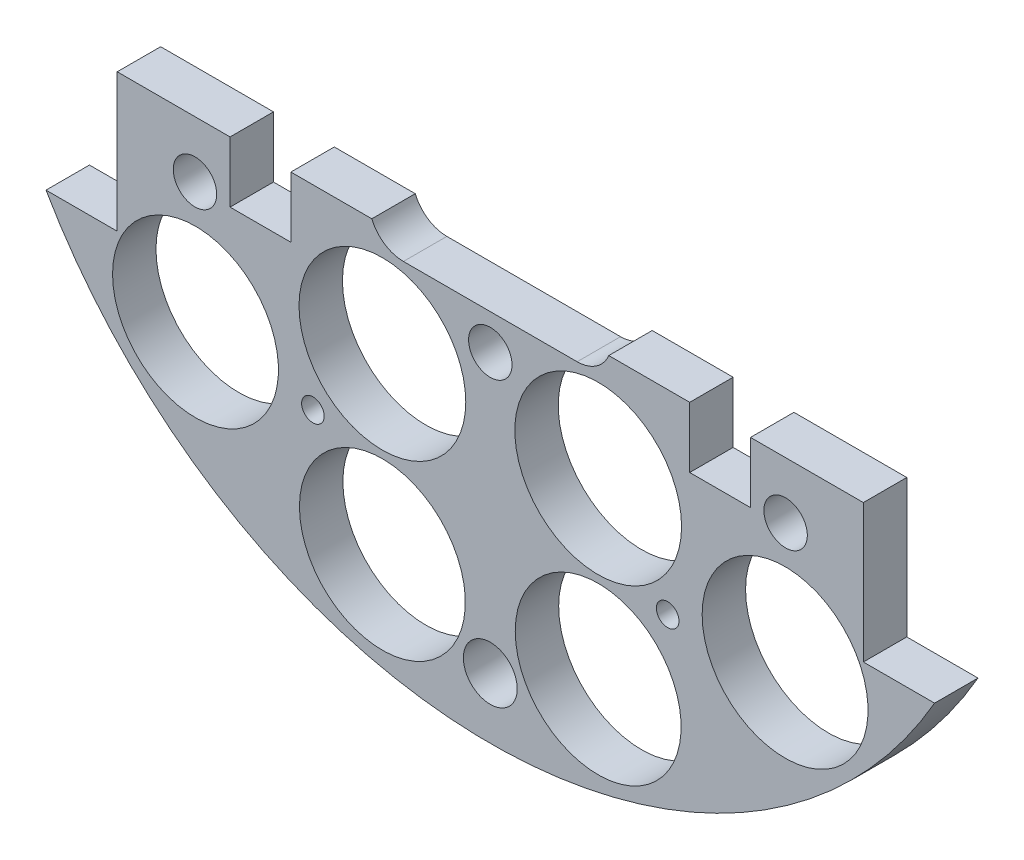
ISO-10303-21;
HEADER;
FILE_DESCRIPTION(('STEP AP214'),'2;1');
FILE_NAME('part.step','',(''),(''),'','','');
FILE_SCHEMA(('AUTOMOTIVE_DESIGN { 1 0 10303 214 1 1 1 1 }'));
ENDSEC;
DATA;
#1=APPLICATION_CONTEXT('core data for automotive mechanical design processes');
#2=APPLICATION_PROTOCOL_DEFINITION('international standard','automotive_design',2000,#1);
#3=PRODUCT_CONTEXT('',#1,'mechanical');
#4=PRODUCT('Part','Part','',(#3));
#5=PRODUCT_RELATED_PRODUCT_CATEGORY('part','',(#4));
#6=PRODUCT_DEFINITION_FORMATION('','',#4);
#7=PRODUCT_DEFINITION_CONTEXT('part definition',#1,'design');
#8=PRODUCT_DEFINITION('design','',#6,#7);
#9=PRODUCT_DEFINITION_SHAPE('','',#8);
#10=(LENGTH_UNIT() NAMED_UNIT(*) SI_UNIT(.MILLI.,.METRE.));
#11=(NAMED_UNIT(*) PLANE_ANGLE_UNIT() SI_UNIT($,.RADIAN.));
#12=(NAMED_UNIT(*) SI_UNIT($,.STERADIAN.) SOLID_ANGLE_UNIT());
#13=UNCERTAINTY_MEASURE_WITH_UNIT(LENGTH_MEASURE(1.E-05),#10,'distance_accuracy_value','');
#14=(GEOMETRIC_REPRESENTATION_CONTEXT(3) GLOBAL_UNCERTAINTY_ASSIGNED_CONTEXT((#13)) GLOBAL_UNIT_ASSIGNED_CONTEXT((#10,
#11,#12)) REPRESENTATION_CONTEXT('',''));
#15=CARTESIAN_POINT('',(0.,0.,0.));
#16=DIRECTION('',(0.,0.,1.));
#17=DIRECTION('',(1.,0.,0.));
#18=AXIS2_PLACEMENT_3D('',#15,#16,#17);
#19=CARTESIAN_POINT('',(85.0440360772851,-17.145,6.35));
#20=DIRECTION('',(0.,-1.,0.));
#21=DIRECTION('',(0.,0.,-1.));
#22=AXIS2_PLACEMENT_3D('',#19,#20,#21);
#23=PLANE('',#22);
#24=DIRECTION('',(-1.,0.,0.));
#25=VECTOR('',#24,1.);
#26=CARTESIAN_POINT('',(85.0440360772851,-17.145,6.35));
#27=LINE('',#26,#25);
#28=CARTESIAN_POINT('',(-17.3228751875862,-17.145,6.35));
#29=VERTEX_POINT('',#28);
#30=CARTESIAN_POINT('',(-29.1604414737786,-17.145,6.35));
#31=VERTEX_POINT('',#30);
#32=EDGE_CURVE('E268',#29,#31,#27,.T.);
#33=ORIENTED_EDGE('',*,*,#32,.F.);
#34=DIRECTION('',(0.,0.,-1.));
#35=VECTOR('',#34,1.);
#36=CARTESIAN_POINT('',(-17.3228751875862,-17.145,21.59));
#37=LINE('',#36,#35);
#38=CARTESIAN_POINT('',(-17.3228751875862,-17.145,0.));
#39=VERTEX_POINT('',#38);
#40=EDGE_CURVE('E191',#29,#39,#37,.T.);
#41=ORIENTED_EDGE('',*,*,#40,.T.);
#42=DIRECTION('',(-1.,0.,0.));
#43=VECTOR('',#42,1.);
#44=CARTESIAN_POINT('',(85.0440360772851,-17.145,0.));
#45=LINE('',#44,#43);
#46=CARTESIAN_POINT('',(-29.1604414737786,-17.145,0.));
#47=VERTEX_POINT('',#46);
#48=EDGE_CURVE('E274',#39,#47,#45,.T.);
#49=ORIENTED_EDGE('',*,*,#48,.T.);
#50=DIRECTION('',(0.,0.,-1.));
#51=VECTOR('',#50,1.);
#52=CARTESIAN_POINT('',(-29.1604414737786,-17.145,6.35));
#53=LINE('',#52,#51);
#54=EDGE_CURVE('E222',#31,#47,#53,.T.);
#55=ORIENTED_EDGE('',*,*,#54,.F.);
#56=EDGE_LOOP('',(#33,#41,#49,#55));
#57=FACE_BOUND('',#56,.T.);
#58=ADVANCED_FACE('F33',(#57),#23,.F.);
#59=CARTESIAN_POINT('',(29.1604414737786,-17.145,0.));
#60=VERTEX_POINT('',#59);
#61=CARTESIAN_POINT('',(17.3228751875862,-17.145,0.));
#62=VERTEX_POINT('',#61);
#63=EDGE_CURVE('E273',#60,#62,#45,.T.);
#64=ORIENTED_EDGE('',*,*,#63,.T.);
#65=DIRECTION('',(0.,0.,-1.));
#66=VECTOR('',#65,1.);
#67=CARTESIAN_POINT('',(17.3228751875862,-17.145,21.59));
#68=LINE('',#67,#66);
#69=CARTESIAN_POINT('',(17.3228751875862,-17.145,6.35));
#70=VERTEX_POINT('',#69);
#71=EDGE_CURVE('E48',#62,#70,#68,.F.);
#72=ORIENTED_EDGE('',*,*,#71,.T.);
#73=CARTESIAN_POINT('',(29.1604414737786,-17.145,6.35));
#74=VERTEX_POINT('',#73);
#75=EDGE_CURVE('E267',#74,#70,#27,.T.);
#76=ORIENTED_EDGE('',*,*,#75,.F.);
#77=DIRECTION('',(0.,0.,-1.));
#78=VECTOR('',#77,1.);
#79=CARTESIAN_POINT('',(29.1604414737786,-17.145,6.35));
#80=LINE('',#79,#78);
#81=EDGE_CURVE('E251',#74,#60,#80,.T.);
#82=ORIENTED_EDGE('',*,*,#81,.T.);
#83=EDGE_LOOP('',(#64,#72,#76,#82));
#84=FACE_BOUND('',#83,.T.);
#85=ADVANCED_FACE('F364',(#84),#23,.F.);
#86=CARTESIAN_POINT('',(54.5504414737786,-17.145,0.));
#87=VERTEX_POINT('',#86);
#88=CARTESIAN_POINT('',(38.0504414737786,-17.145,0.));
#89=VERTEX_POINT('',#88);
#90=EDGE_CURVE('E269',#87,#89,#45,.T.);
#91=ORIENTED_EDGE('',*,*,#90,.T.);
#92=DIRECTION('',(0.,0.,-1.));
#93=VECTOR('',#92,1.);
#94=CARTESIAN_POINT('',(38.0504414737786,-17.145,6.35));
#95=LINE('',#94,#93);
#96=CARTESIAN_POINT('',(38.0504414737786,-17.145,6.35));
#97=VERTEX_POINT('',#96);
#98=EDGE_CURVE('E248',#97,#89,#95,.T.);
#99=ORIENTED_EDGE('',*,*,#98,.F.);
#100=CARTESIAN_POINT('',(54.5504414737786,-17.145,6.35));
#101=VERTEX_POINT('',#100);
#102=EDGE_CURVE('E263',#101,#97,#27,.T.);
#103=ORIENTED_EDGE('',*,*,#102,.F.);
#104=DIRECTION('',(0.,0.,1.));
#105=VECTOR('',#104,1.);
#106=CARTESIAN_POINT('',(54.5504414737786,-17.145,6.35));
#107=LINE('',#106,#105);
#108=EDGE_CURVE('E41',#87,#101,#107,.T.);
#109=ORIENTED_EDGE('',*,*,#108,.F.);
#110=EDGE_LOOP('',(#91,#99,#103,#109));
#111=FACE_BOUND('',#110,.T.);
#112=ADVANCED_FACE('F371',(#111),#23,.F.);
#113=CARTESIAN_POINT('',(0.,0.,6.35));
#114=DIRECTION('',(0.,0.,1.));
#115=DIRECTION('',(1.,0.,0.));
#116=AXIS2_PLACEMENT_3D('',#113,#114,#115);
#117=PLANE('',#116);
#118=CARTESIAN_POINT('',(-25.9376089894497,-45.645229381132,6.35));
#119=DIRECTION('',(0.,0.,1.));
#120=DIRECTION('',(1.,0.,0.));
#121=AXIS2_PLACEMENT_3D('',#118,#119,#120);
#122=CIRCLE('',#121,1.651);
#123=CARTESIAN_POINT('',(-24.2866089894497,-45.645229381132,6.35));
#124=VERTEX_POINT('',#123);
#125=EDGE_CURVE('E609',#124,#124,#122,.T.);
#126=ORIENTED_EDGE('',*,*,#125,.F.);
#127=EDGE_LOOP('',(#126));
#128=FACE_BOUND('',#127,.T.);
#129=CARTESIAN_POINT('',(25.9376089894497,-45.645229381132,6.35));
#130=DIRECTION('',(0.,0.,1.));
#131=DIRECTION('',(1.,0.,0.));
#132=AXIS2_PLACEMENT_3D('',#129,#130,#131);
#133=CIRCLE('',#132,1.651);
#134=CARTESIAN_POINT('',(27.5886089894497,-45.645229381132,6.35));
#135=VERTEX_POINT('',#134);
#136=EDGE_CURVE('E619',#135,#135,#133,.T.);
#137=ORIENTED_EDGE('',*,*,#136,.F.);
#138=EDGE_LOOP('',(#137));
#139=FACE_BOUND('',#138,.T.);
#140=CARTESIAN_POINT('',(15.7776089894497,-33.4828383705815,6.35));
#141=DIRECTION('',(0.,0.,1.));
#142=DIRECTION('',(1.,0.,0.));
#143=AXIS2_PLACEMENT_3D('',#140,#141,#142);
#144=CIRCLE('',#143,12.192);
#145=CARTESIAN_POINT('',(27.9696089894497,-33.4828383705815,6.35));
#146=VERTEX_POINT('',#145);
#147=EDGE_CURVE('E625',#146,#146,#144,.T.);
#148=ORIENTED_EDGE('',*,*,#147,.F.);
#149=EDGE_LOOP('',(#148));
#150=FACE_BOUND('',#149,.T.);
#151=CARTESIAN_POINT('',(-15.7776089894497,-33.4828383705816,6.35));
#152=DIRECTION('',(0.,0.,1.));
#153=DIRECTION('',(1.,0.,0.));
#154=AXIS2_PLACEMENT_3D('',#151,#152,#153);
#155=CIRCLE('',#154,12.192);
#156=CARTESIAN_POINT('',(-3.58560898944972,-33.4828383705816,6.35));
#157=VERTEX_POINT('',#156);
#158=EDGE_CURVE('E176',#157,#157,#155,.T.);
#159=ORIENTED_EDGE('',*,*,#158,.F.);
#160=EDGE_LOOP('',(#159));
#161=FACE_BOUND('',#160,.T.);
#162=CARTESIAN_POINT('',(-12.7,-15.24,6.35));
#163=DIRECTION('',(0.,0.,1.));
#164=DIRECTION('',(1.,0.,0.));
#165=AXIS2_PLACEMENT_3D('',#162,#163,#164);
#166=CIRCLE('',#165,5.);
#167=CARTESIAN_POINT('',(-12.7,-20.24,6.35));
#168=VERTEX_POINT('',#167);
#169=EDGE_CURVE('E189',#29,#168,#166,.T.);
#170=ORIENTED_EDGE('',*,*,#169,.F.);
#171=ORIENTED_EDGE('',*,*,#32,.T.);
#172=DIRECTION('',(0.,-1.,0.));
#173=VECTOR('',#172,1.);
#174=CARTESIAN_POINT('',(-29.1604414737786,-17.145,6.35));
#175=LINE('',#174,#173);
#176=CARTESIAN_POINT('',(-29.1604414737786,-26.035,6.35));
#177=VERTEX_POINT('',#176);
#178=EDGE_CURVE('E204',#31,#177,#175,.T.);
#179=ORIENTED_EDGE('',*,*,#178,.T.);
#180=DIRECTION('',(-1.,0.,0.));
#181=VECTOR('',#180,1.);
#182=CARTESIAN_POINT('',(-29.1604414737786,-26.035,6.35));
#183=LINE('',#182,#181);
#184=CARTESIAN_POINT('',(-38.0504414737786,-26.035,6.35));
#185=VERTEX_POINT('',#184);
#186=EDGE_CURVE('E207',#177,#185,#183,.T.);
#187=ORIENTED_EDGE('',*,*,#186,.T.);
#188=DIRECTION('',(0.,1.,0.));
#189=VECTOR('',#188,1.);
#190=CARTESIAN_POINT('',(-38.0504414737786,-17.145,6.35));
#191=LINE('',#190,#189);
#192=CARTESIAN_POINT('',(-38.0504414737786,-17.145,6.35));
#193=VERTEX_POINT('',#192);
#194=EDGE_CURVE('E210',#185,#193,#191,.T.);
#195=ORIENTED_EDGE('',*,*,#194,.T.);
#196=CARTESIAN_POINT('',(-54.5504414737786,-17.145,6.35));
#197=VERTEX_POINT('',#196);
#198=EDGE_CURVE('E272',#193,#197,#27,.T.);
#199=ORIENTED_EDGE('',*,*,#198,.T.);
#200=DIRECTION('',(0.,-1.,0.));
#201=VECTOR('',#200,1.);
#202=CARTESIAN_POINT('',(-54.5504414737786,37.338,6.35));
#203=LINE('',#202,#201);
#204=CARTESIAN_POINT('',(-54.5504414737786,-37.338,6.35));
#205=VERTEX_POINT('',#204);
#206=EDGE_CURVE('E302',#197,#205,#203,.T.);
#207=ORIENTED_EDGE('',*,*,#206,.T.);
#208=DIRECTION('',(-1.,0.,0.));
#209=VECTOR('',#208,1.);
#210=CARTESIAN_POINT('',(-64.9644414737785,-37.338,6.35));
#211=LINE('',#210,#209);
#212=CARTESIAN_POINT('',(-64.9644414737785,-37.338,6.35));
#213=VERTEX_POINT('',#212);
#214=EDGE_CURVE('E304',#205,#213,#211,.T.);
#215=ORIENTED_EDGE('',*,*,#214,.T.);
#216=CARTESIAN_POINT('',(0.,0.,6.35));
#217=DIRECTION('',(0.,0.,1.));
#218=DIRECTION('',(1.,0.,0.));
#219=AXIS2_PLACEMENT_3D('',#216,#217,#218);
#220=CIRCLE('',#219,74.93);
#221=CARTESIAN_POINT('',(64.9644414737785,-37.338,6.35));
#222=VERTEX_POINT('',#221);
#223=EDGE_CURVE('E307',#213,#222,#220,.T.);
#224=ORIENTED_EDGE('',*,*,#223,.T.);
#225=DIRECTION('',(-1.,0.,0.));
#226=VECTOR('',#225,1.);
#227=CARTESIAN_POINT('',(64.9644414737785,-37.338,6.35));
#228=LINE('',#227,#226);
#229=CARTESIAN_POINT('',(54.5504414737786,-37.338,6.35));
#230=VERTEX_POINT('',#229);
#231=EDGE_CURVE('E309',#222,#230,#228,.T.);
#232=ORIENTED_EDGE('',*,*,#231,.T.);
#233=DIRECTION('',(0.,1.,0.));
#234=VECTOR('',#233,1.);
#235=CARTESIAN_POINT('',(54.5504414737786,37.338,6.35));
#236=LINE('',#235,#234);
#237=EDGE_CURVE('E311',#230,#101,#236,.T.);
#238=ORIENTED_EDGE('',*,*,#237,.T.);
#239=ORIENTED_EDGE('',*,*,#102,.T.);
#240=DIRECTION('',(0.,-1.,0.));
#241=VECTOR('',#240,1.);
#242=CARTESIAN_POINT('',(38.0504414737786,-17.145,6.35));
#243=LINE('',#242,#241);
#244=CARTESIAN_POINT('',(38.0504414737786,-26.035,6.35));
#245=VERTEX_POINT('',#244);
#246=EDGE_CURVE('E231',#97,#245,#243,.T.);
#247=ORIENTED_EDGE('',*,*,#246,.T.);
#248=DIRECTION('',(-1.,0.,0.));
#249=VECTOR('',#248,1.);
#250=CARTESIAN_POINT('',(38.0504414737786,-26.035,6.35));
#251=LINE('',#250,#249);
#252=CARTESIAN_POINT('',(29.1604414737786,-26.035,6.35));
#253=VERTEX_POINT('',#252);
#254=EDGE_CURVE('E234',#245,#253,#251,.T.);
#255=ORIENTED_EDGE('',*,*,#254,.T.);
#256=DIRECTION('',(0.,1.,0.));
#257=VECTOR('',#256,1.);
#258=CARTESIAN_POINT('',(29.1604414737786,-17.145,6.35));
#259=LINE('',#258,#257);
#260=EDGE_CURVE('E238',#253,#74,#259,.T.);
#261=ORIENTED_EDGE('',*,*,#260,.T.);
#262=ORIENTED_EDGE('',*,*,#75,.T.);
#263=CARTESIAN_POINT('',(12.7,-15.24,6.35));
#264=DIRECTION('',(0.,0.,1.));
#265=DIRECTION('',(1.,0.,0.));
#266=AXIS2_PLACEMENT_3D('',#263,#264,#265);
#267=CIRCLE('',#266,5.);
#268=CARTESIAN_POINT('',(12.7,-20.24,6.35));
#269=VERTEX_POINT('',#268);
#270=EDGE_CURVE('E184',#269,#70,#267,.T.);
#271=ORIENTED_EDGE('',*,*,#270,.F.);
#272=DIRECTION('',(1.,0.,0.));
#273=VECTOR('',#272,1.);
#274=CARTESIAN_POINT('',(0.,-20.24,6.35));
#275=LINE('',#274,#273);
#276=EDGE_CURVE('E165',#168,#269,#275,.T.);
#277=ORIENTED_EDGE('',*,*,#276,.F.);
#278=EDGE_LOOP('',(#170,#171,#179,#187,#195,#199,#207,#215,#224,#232,#238,#239,#247,#255,#261,
#262,#271,#277));
#279=FACE_BOUND('',#278,.T.);
#280=CARTESIAN_POINT('',(-43.18,-25.4,6.35));
#281=DIRECTION('',(0.,0.,-1.));
#282=DIRECTION('',(1.,0.,0.));
#283=AXIS2_PLACEMENT_3D('',#280,#281,#282);
#284=CIRCLE('',#283,3.175);
#285=CARTESIAN_POINT('',(-40.005,-25.4,6.35));
#286=VERTEX_POINT('',#285);
#287=EDGE_CURVE('E195',#286,#286,#284,.T.);
#288=ORIENTED_EDGE('',*,*,#287,.T.);
#289=EDGE_LOOP('',(#288));
#290=FACE_BOUND('',#289,.T.);
#291=CARTESIAN_POINT('',(0.,-25.4,6.35));
#292=DIRECTION('',(0.,0.,-1.));
#293=DIRECTION('',(1.,0.,0.));
#294=AXIS2_PLACEMENT_3D('',#291,#292,#293);
#295=CIRCLE('',#294,3.175);
#296=CARTESIAN_POINT('',(3.17500000000002,-25.4,6.35));
#297=VERTEX_POINT('',#296);
#298=EDGE_CURVE('E199',#297,#297,#295,.T.);
#299=ORIENTED_EDGE('',*,*,#298,.T.);
#300=EDGE_LOOP('',(#299));
#301=FACE_BOUND('',#300,.T.);
#302=CARTESIAN_POINT('',(43.18,-25.4,6.35));
#303=DIRECTION('',(0.,0.,-1.));
#304=DIRECTION('',(-1.,0.,0.));
#305=AXIS2_PLACEMENT_3D('',#302,#303,#304);
#306=CIRCLE('',#305,3.175);
#307=CARTESIAN_POINT('',(40.005,-25.4,6.35));
#308=VERTEX_POINT('',#307);
#309=EDGE_CURVE('E194',#308,#308,#306,.T.);
#310=ORIENTED_EDGE('',*,*,#309,.T.);
#311=EDGE_LOOP('',(#310));
#312=FACE_BOUND('',#311,.T.);
#313=CARTESIAN_POINT('',(0.,-66.045,6.35));
#314=DIRECTION('',(0.,0.,-1.));
#315=DIRECTION('',(-1.,0.,0.));
#316=AXIS2_PLACEMENT_3D('',#313,#314,#315);
#317=CIRCLE('',#316,3.937);
#318=CARTESIAN_POINT('',(-3.937,-66.045,6.35));
#319=VERTEX_POINT('',#318);
#320=EDGE_CURVE('E257',#319,#319,#317,.T.);
#321=ORIENTED_EDGE('',*,*,#320,.T.);
#322=EDGE_LOOP('',(#321));
#323=FACE_BOUND('',#322,.T.);
#324=CARTESIAN_POINT('',(-43.105229381132,-43.1052293811318,6.35));
#325=DIRECTION('',(0.,0.,-1.));
#326=DIRECTION('',(-1.,0.,0.));
#327=AXIS2_PLACEMENT_3D('',#324,#325,#326);
#328=CIRCLE('',#327,12.1285);
#329=CARTESIAN_POINT('',(-55.233729381132,-43.1052293811318,6.35));
#330=VERTEX_POINT('',#329);
#331=EDGE_CURVE('E278',#330,#330,#328,.T.);
#332=ORIENTED_EDGE('',*,*,#331,.T.);
#333=EDGE_LOOP('',(#332));
#334=FACE_BOUND('',#333,.T.);
#335=CARTESIAN_POINT('',(43.1052293811319,-43.105229381132,6.35));
#336=DIRECTION('',(0.,0.,-1.));
#337=DIRECTION('',(-1.,0.,0.));
#338=AXIS2_PLACEMENT_3D('',#335,#336,#337);
#339=CIRCLE('',#338,12.1285);
#340=CARTESIAN_POINT('',(30.9767293811319,-43.105229381132,6.35));
#341=VERTEX_POINT('',#340);
#342=EDGE_CURVE('E291',#341,#341,#339,.T.);
#343=ORIENTED_EDGE('',*,*,#342,.T.);
#344=EDGE_LOOP('',(#343));
#345=FACE_BOUND('',#344,.T.);
#346=CARTESIAN_POINT('',(15.7776089894496,-58.8828383705816,6.35));
#347=DIRECTION('',(0.,0.,-1.));
#348=DIRECTION('',(-1.,0.,0.));
#349=AXIS2_PLACEMENT_3D('',#346,#347,#348);
#350=CIRCLE('',#349,12.1285);
#351=CARTESIAN_POINT('',(3.64910898944961,-58.8828383705816,6.35));
#352=VERTEX_POINT('',#351);
#353=EDGE_CURVE('E284',#352,#352,#350,.T.);
#354=ORIENTED_EDGE('',*,*,#353,.T.);
#355=EDGE_LOOP('',(#354));
#356=FACE_BOUND('',#355,.T.);
#357=CARTESIAN_POINT('',(-15.7776089894497,-58.8828383705816,6.35));
#358=DIRECTION('',(0.,0.,-1.));
#359=DIRECTION('',(-1.,0.,0.));
#360=AXIS2_PLACEMENT_3D('',#357,#358,#359);
#361=CIRCLE('',#360,12.1285);
#362=CARTESIAN_POINT('',(-27.9061089894497,-58.8828383705816,6.35));
#363=VERTEX_POINT('',#362);
#364=EDGE_CURVE('E296',#363,#363,#361,.T.);
#365=ORIENTED_EDGE('',*,*,#364,.T.);
#366=EDGE_LOOP('',(#365));
#367=FACE_BOUND('',#366,.T.);
#368=ADVANCED_FACE('F390',(#128,#139,#150,#161,#279,#290,#301,#312,#323,#334,#345,#356,#367),
#117,.T.);
#369=CARTESIAN_POINT('',(0.,0.,0.));
#370=DIRECTION('',(0.,0.,1.));
#371=DIRECTION('',(1.,0.,0.));
#372=AXIS2_PLACEMENT_3D('',#369,#370,#371);
#373=PLANE('',#372);
#374=CARTESIAN_POINT('',(-25.9376089894497,-45.645229381132,0.));
#375=DIRECTION('',(0.,0.,-1.));
#376=DIRECTION('',(1.,0.,0.));
#377=AXIS2_PLACEMENT_3D('',#374,#375,#376);
#378=CIRCLE('',#377,1.651);
#379=CARTESIAN_POINT('',(-24.2866089894497,-45.645229381132,0.));
#380=VERTEX_POINT('',#379);
#381=EDGE_CURVE('E612',#380,#380,#378,.T.);
#382=ORIENTED_EDGE('',*,*,#381,.F.);
#383=EDGE_LOOP('',(#382));
#384=FACE_BOUND('',#383,.T.);
#385=CARTESIAN_POINT('',(25.9376089894497,-45.645229381132,0.));
#386=DIRECTION('',(0.,0.,-1.));
#387=DIRECTION('',(-1.,0.,0.));
#388=AXIS2_PLACEMENT_3D('',#385,#386,#387);
#389=CIRCLE('',#388,1.651);
#390=CARTESIAN_POINT('',(24.2866089894497,-45.645229381132,0.));
#391=VERTEX_POINT('',#390);
#392=EDGE_CURVE('E614',#391,#391,#389,.T.);
#393=ORIENTED_EDGE('',*,*,#392,.F.);
#394=EDGE_LOOP('',(#393));
#395=FACE_BOUND('',#394,.T.);
#396=CARTESIAN_POINT('',(15.7776089894497,-33.4828383705815,0.));
#397=DIRECTION('',(0.,0.,-1.));
#398=DIRECTION('',(1.,0.,0.));
#399=AXIS2_PLACEMENT_3D('',#396,#397,#398);
#400=CIRCLE('',#399,12.192);
#401=CARTESIAN_POINT('',(27.9696089894497,-33.4828383705815,0.));
#402=VERTEX_POINT('',#401);
#403=EDGE_CURVE('E622',#402,#402,#400,.T.);
#404=ORIENTED_EDGE('',*,*,#403,.F.);
#405=EDGE_LOOP('',(#404));
#406=FACE_BOUND('',#405,.T.);
#407=CARTESIAN_POINT('',(-15.7776089894497,-33.4828383705816,0.));
#408=DIRECTION('',(0.,0.,-1.));
#409=DIRECTION('',(-1.,0.,0.));
#410=AXIS2_PLACEMENT_3D('',#407,#408,#409);
#411=CIRCLE('',#410,12.192);
#412=CARTESIAN_POINT('',(-27.9696089894497,-33.4828383705816,0.));
#413=VERTEX_POINT('',#412);
#414=EDGE_CURVE('E180',#413,#413,#411,.T.);
#415=ORIENTED_EDGE('',*,*,#414,.F.);
#416=EDGE_LOOP('',(#415));
#417=FACE_BOUND('',#416,.T.);
#418=CARTESIAN_POINT('',(-43.18,-25.4,0.));
#419=DIRECTION('',(0.,0.,1.));
#420=DIRECTION('',(1.,0.,0.));
#421=AXIS2_PLACEMENT_3D('',#418,#419,#420);
#422=CIRCLE('',#421,3.175);
#423=CARTESIAN_POINT('',(-40.005,-25.4,0.));
#424=VERTEX_POINT('',#423);
#425=EDGE_CURVE('E218',#424,#424,#422,.T.);
#426=ORIENTED_EDGE('',*,*,#425,.T.);
#427=EDGE_LOOP('',(#426));
#428=FACE_BOUND('',#427,.T.);
#429=CARTESIAN_POINT('',(0.,-25.4,0.));
#430=DIRECTION('',(0.,0.,1.));
#431=DIRECTION('',(1.,0.,0.));
#432=AXIS2_PLACEMENT_3D('',#429,#430,#431);
#433=CIRCLE('',#432,3.175);
#434=CARTESIAN_POINT('',(3.17500000000002,-25.4,0.));
#435=VERTEX_POINT('',#434);
#436=EDGE_CURVE('E339',#435,#435,#433,.T.);
#437=ORIENTED_EDGE('',*,*,#436,.T.);
#438=EDGE_LOOP('',(#437));
#439=FACE_BOUND('',#438,.T.);
#440=CARTESIAN_POINT('',(43.18,-25.4,0.));
#441=DIRECTION('',(0.,0.,1.));
#442=DIRECTION('',(1.,0.,0.));
#443=AXIS2_PLACEMENT_3D('',#440,#441,#442);
#444=CIRCLE('',#443,3.175);
#445=CARTESIAN_POINT('',(46.355,-25.4,0.));
#446=VERTEX_POINT('',#445);
#447=EDGE_CURVE('E198',#446,#446,#444,.T.);
#448=ORIENTED_EDGE('',*,*,#447,.T.);
#449=EDGE_LOOP('',(#448));
#450=FACE_BOUND('',#449,.T.);
#451=CARTESIAN_POINT('',(0.,-66.045,0.));
#452=DIRECTION('',(0.,0.,-1.));
#453=DIRECTION('',(-1.,0.,0.));
#454=AXIS2_PLACEMENT_3D('',#451,#452,#453);
#455=CIRCLE('',#454,3.937);
#456=CARTESIAN_POINT('',(-3.937,-66.045,0.));
#457=VERTEX_POINT('',#456);
#458=EDGE_CURVE('E250',#457,#457,#455,.T.);
#459=ORIENTED_EDGE('',*,*,#458,.F.);
#460=EDGE_LOOP('',(#459));
#461=FACE_BOUND('',#460,.T.);
#462=CARTESIAN_POINT('',(-43.105229381132,-43.1052293811318,0.));
#463=DIRECTION('',(0.,0.,-1.));
#464=DIRECTION('',(-1.,0.,0.));
#465=AXIS2_PLACEMENT_3D('',#462,#463,#464);
#466=CIRCLE('',#465,12.1285);
#467=CARTESIAN_POINT('',(-55.233729381132,-43.1052293811318,0.));
#468=VERTEX_POINT('',#467);
#469=EDGE_CURVE('E277',#468,#468,#466,.T.);
#470=ORIENTED_EDGE('',*,*,#469,.F.);
#471=EDGE_LOOP('',(#470));
#472=FACE_BOUND('',#471,.T.);
#473=CARTESIAN_POINT('',(43.1052293811319,-43.105229381132,0.));
#474=DIRECTION('',(0.,0.,-1.));
#475=DIRECTION('',(-1.,0.,0.));
#476=AXIS2_PLACEMENT_3D('',#473,#474,#475);
#477=CIRCLE('',#476,12.1285);
#478=CARTESIAN_POINT('',(30.9767293811319,-43.105229381132,0.));
#479=VERTEX_POINT('',#478);
#480=EDGE_CURVE('E281',#479,#479,#477,.T.);
#481=ORIENTED_EDGE('',*,*,#480,.F.);
#482=EDGE_LOOP('',(#481));
#483=FACE_BOUND('',#482,.T.);
#484=CARTESIAN_POINT('',(15.7776089894496,-58.8828383705816,0.));
#485=DIRECTION('',(0.,0.,-1.));
#486=DIRECTION('',(-1.,0.,0.));
#487=AXIS2_PLACEMENT_3D('',#484,#485,#486);
#488=CIRCLE('',#487,12.1285);
#489=CARTESIAN_POINT('',(3.64910898944961,-58.8828383705816,0.));
#490=VERTEX_POINT('',#489);
#491=EDGE_CURVE('E288',#490,#490,#488,.T.);
#492=ORIENTED_EDGE('',*,*,#491,.F.);
#493=EDGE_LOOP('',(#492));
#494=FACE_BOUND('',#493,.T.);
#495=CARTESIAN_POINT('',(-15.7776089894497,-58.8828383705816,0.));
#496=DIRECTION('',(0.,0.,-1.));
#497=DIRECTION('',(-1.,0.,0.));
#498=AXIS2_PLACEMENT_3D('',#495,#496,#497);
#499=CIRCLE('',#498,12.1285);
#500=CARTESIAN_POINT('',(-27.9061089894497,-58.8828383705816,0.));
#501=VERTEX_POINT('',#500);
#502=EDGE_CURVE('E287',#501,#501,#499,.T.);
#503=ORIENTED_EDGE('',*,*,#502,.F.);
#504=EDGE_LOOP('',(#503));
#505=FACE_BOUND('',#504,.T.);
#506=ORIENTED_EDGE('',*,*,#48,.F.);
#507=CARTESIAN_POINT('',(-12.7,-15.24,0.));
#508=DIRECTION('',(0.,0.,-1.));
#509=DIRECTION('',(1.,0.,0.));
#510=AXIS2_PLACEMENT_3D('',#507,#508,#509);
#511=CIRCLE('',#510,5.);
#512=CARTESIAN_POINT('',(-12.7,-20.24,0.));
#513=VERTEX_POINT('',#512);
#514=EDGE_CURVE('E168',#513,#39,#511,.T.);
#515=ORIENTED_EDGE('',*,*,#514,.F.);
#516=DIRECTION('',(-1.,0.,0.));
#517=VECTOR('',#516,1.);
#518=CARTESIAN_POINT('',(6.06,-20.24,0.));
#519=LINE('',#518,#517);
#520=CARTESIAN_POINT('',(12.7,-20.24,0.));
#521=VERTEX_POINT('',#520);
#522=EDGE_CURVE('E162',#521,#513,#519,.T.);
#523=ORIENTED_EDGE('',*,*,#522,.F.);
#524=CARTESIAN_POINT('',(12.7,-15.24,0.));
#525=DIRECTION('',(0.,0.,1.));
#526=DIRECTION('',(1.,0.,0.));
#527=AXIS2_PLACEMENT_3D('',#524,#525,#526);
#528=CIRCLE('',#527,5.);
#529=EDGE_CURVE('E11',#521,#62,#528,.T.);
#530=ORIENTED_EDGE('',*,*,#529,.T.);
#531=ORIENTED_EDGE('',*,*,#63,.F.);
#532=DIRECTION('',(0.,1.,0.));
#533=VECTOR('',#532,1.);
#534=CARTESIAN_POINT('',(29.1604414737786,-17.145,0.));
#535=LINE('',#534,#533);
#536=CARTESIAN_POINT('',(29.1604414737786,-26.035,0.));
#537=VERTEX_POINT('',#536);
#538=EDGE_CURVE('E235',#537,#60,#535,.T.);
#539=ORIENTED_EDGE('',*,*,#538,.F.);
#540=DIRECTION('',(-1.,0.,0.));
#541=VECTOR('',#540,1.);
#542=CARTESIAN_POINT('',(38.0504414737786,-26.035,0.));
#543=LINE('',#542,#541);
#544=CARTESIAN_POINT('',(38.0504414737786,-26.035,0.));
#545=VERTEX_POINT('',#544);
#546=EDGE_CURVE('E244',#545,#537,#543,.T.);
#547=ORIENTED_EDGE('',*,*,#546,.F.);
#548=DIRECTION('',(0.,-1.,0.));
#549=VECTOR('',#548,1.);
#550=CARTESIAN_POINT('',(38.0504414737786,-17.145,0.));
#551=LINE('',#550,#549);
#552=EDGE_CURVE('E225',#89,#545,#551,.T.);
#553=ORIENTED_EDGE('',*,*,#552,.F.);
#554=ORIENTED_EDGE('',*,*,#90,.F.);
#555=DIRECTION('',(0.,1.,0.));
#556=VECTOR('',#555,1.);
#557=CARTESIAN_POINT('',(54.5504414737786,37.338,0.));
#558=LINE('',#557,#556);
#559=CARTESIAN_POINT('',(54.5504414737786,-37.338,0.));
#560=VERTEX_POINT('',#559);
#561=EDGE_CURVE('E305',#560,#87,#558,.T.);
#562=ORIENTED_EDGE('',*,*,#561,.F.);
#563=DIRECTION('',(-1.,0.,0.));
#564=VECTOR('',#563,1.);
#565=CARTESIAN_POINT('',(64.9644414737785,-37.338,0.));
#566=LINE('',#565,#564);
#567=CARTESIAN_POINT('',(64.9644414737785,-37.338,0.));
#568=VERTEX_POINT('',#567);
#569=EDGE_CURVE('E320',#568,#560,#566,.T.);
#570=ORIENTED_EDGE('',*,*,#569,.F.);
#571=CARTESIAN_POINT('',(0.,0.,0.));
#572=DIRECTION('',(0.,0.,1.));
#573=DIRECTION('',(1.,0.,0.));
#574=AXIS2_PLACEMENT_3D('',#571,#572,#573);
#575=CIRCLE('',#574,74.93);
#576=CARTESIAN_POINT('',(-64.9644414737785,-37.338,0.));
#577=VERTEX_POINT('',#576);
#578=EDGE_CURVE('E318',#577,#568,#575,.T.);
#579=ORIENTED_EDGE('',*,*,#578,.F.);
#580=DIRECTION('',(-1.,0.,0.));
#581=VECTOR('',#580,1.);
#582=CARTESIAN_POINT('',(-64.9644414737785,-37.338,0.));
#583=LINE('',#582,#581);
#584=CARTESIAN_POINT('',(-54.5504414737786,-37.338,0.));
#585=VERTEX_POINT('',#584);
#586=EDGE_CURVE('E316',#585,#577,#583,.T.);
#587=ORIENTED_EDGE('',*,*,#586,.F.);
#588=DIRECTION('',(0.,-1.,0.));
#589=VECTOR('',#588,1.);
#590=CARTESIAN_POINT('',(-54.5504414737786,37.338,0.));
#591=LINE('',#590,#589);
#592=CARTESIAN_POINT('',(-54.5504414737786,-17.145,0.));
#593=VERTEX_POINT('',#592);
#594=EDGE_CURVE('E299',#593,#585,#591,.T.);
#595=ORIENTED_EDGE('',*,*,#594,.F.);
#596=CARTESIAN_POINT('',(-38.0504414737786,-17.145,0.));
#597=VERTEX_POINT('',#596);
#598=EDGE_CURVE('E260',#597,#593,#45,.T.);
#599=ORIENTED_EDGE('',*,*,#598,.F.);
#600=DIRECTION('',(0.,1.,0.));
#601=VECTOR('',#600,1.);
#602=CARTESIAN_POINT('',(-38.0504414737786,-17.145,0.));
#603=LINE('',#602,#601);
#604=CARTESIAN_POINT('',(-38.0504414737786,-26.035,0.));
#605=VERTEX_POINT('',#604);
#606=EDGE_CURVE('E55',#605,#597,#603,.T.);
#607=ORIENTED_EDGE('',*,*,#606,.F.);
#608=DIRECTION('',(-1.,0.,0.));
#609=VECTOR('',#608,1.);
#610=CARTESIAN_POINT('',(-29.1604414737786,-26.035,0.));
#611=LINE('',#610,#609);
#612=CARTESIAN_POINT('',(-29.1604414737786,-26.035,0.));
#613=VERTEX_POINT('',#612);
#614=EDGE_CURVE('E217',#613,#605,#611,.T.);
#615=ORIENTED_EDGE('',*,*,#614,.F.);
#616=DIRECTION('',(0.,-1.,0.));
#617=VECTOR('',#616,1.);
#618=CARTESIAN_POINT('',(-29.1604414737786,-17.145,0.));
#619=LINE('',#618,#617);
#620=EDGE_CURVE('E214',#47,#613,#619,.T.);
#621=ORIENTED_EDGE('',*,*,#620,.F.);
#622=EDGE_LOOP('',(#506,#515,#523,#530,#531,#539,#547,#553,#554,#562,#570,#579,#587,#595,#599,
#607,#615,#621));
#623=FACE_BOUND('',#622,.T.);
#624=ADVANCED_FACE('F175',(#384,#395,#406,#417,#428,#439,#450,#461,#472,#483,#494,#505,#623),
#373,.F.);
#625=CARTESIAN_POINT('',(-54.5504414737786,37.338,6.35));
#626=DIRECTION('',(1.,0.,0.));
#627=DIRECTION('',(0.,1.,0.));
#628=AXIS2_PLACEMENT_3D('',#625,#626,#627);
#629=PLANE('',#628);
#630=ORIENTED_EDGE('',*,*,#206,.F.);
#631=DIRECTION('',(0.,0.,-1.));
#632=VECTOR('',#631,1.);
#633=CARTESIAN_POINT('',(-54.5504414737786,-17.145,6.35));
#634=LINE('',#633,#632);
#635=EDGE_CURVE('E266',#197,#593,#634,.T.);
#636=ORIENTED_EDGE('',*,*,#635,.T.);
#637=ORIENTED_EDGE('',*,*,#594,.T.);
#638=DIRECTION('',(0.,0.,-1.));
#639=VECTOR('',#638,1.);
#640=CARTESIAN_POINT('',(-54.5504414737786,-37.338,6.35));
#641=LINE('',#640,#639);
#642=EDGE_CURVE('E332',#205,#585,#641,.T.);
#643=ORIENTED_EDGE('',*,*,#642,.F.);
#644=EDGE_LOOP('',(#630,#636,#637,#643));
#645=FACE_BOUND('',#644,.T.);
#646=ADVANCED_FACE('F35',(#645),#629,.F.);
#647=CARTESIAN_POINT('',(-64.9644414737785,-37.338,6.35));
#648=DIRECTION('',(0.,-1.,0.));
#649=DIRECTION('',(0.,0.,-1.));
#650=AXIS2_PLACEMENT_3D('',#647,#648,#649);
#651=PLANE('',#650);
#652=ORIENTED_EDGE('',*,*,#586,.T.);
#653=DIRECTION('',(0.,0.,-1.));
#654=VECTOR('',#653,1.);
#655=CARTESIAN_POINT('',(-64.9644414737785,-37.338,6.35));
#656=LINE('',#655,#654);
#657=EDGE_CURVE('E329',#213,#577,#656,.T.);
#658=ORIENTED_EDGE('',*,*,#657,.F.);
#659=ORIENTED_EDGE('',*,*,#214,.F.);
#660=ORIENTED_EDGE('',*,*,#642,.T.);
#661=EDGE_LOOP('',(#652,#658,#659,#660));
#662=FACE_BOUND('',#661,.T.);
#663=ADVANCED_FACE('F420',(#662),#651,.F.);
#664=CARTESIAN_POINT('',(0.,0.,6.35));
#665=DIRECTION('',(0.,0.,-1.));
#666=DIRECTION('',(-1.,0.,0.));
#667=AXIS2_PLACEMENT_3D('',#664,#665,#666);
#668=CYLINDRICAL_SURFACE('',#667,74.93);
#669=ORIENTED_EDGE('',*,*,#578,.T.);
#670=DIRECTION('',(0.,0.,-1.));
#671=VECTOR('',#670,1.);
#672=CARTESIAN_POINT('',(64.9644414737785,-37.338,6.35));
#673=LINE('',#672,#671);
#674=EDGE_CURVE('E326',#222,#568,#673,.T.);
#675=ORIENTED_EDGE('',*,*,#674,.F.);
#676=ORIENTED_EDGE('',*,*,#223,.F.);
#677=ORIENTED_EDGE('',*,*,#657,.T.);
#678=EDGE_LOOP('',(#669,#675,#676,#677));
#679=FACE_BOUND('',#678,.T.);
#680=ADVANCED_FACE('F415',(#679),#668,.T.);
#681=CARTESIAN_POINT('',(64.9644414737785,-37.338,6.35));
#682=DIRECTION('',(0.,-1.,0.));
#683=DIRECTION('',(0.,0.,-1.));
#684=AXIS2_PLACEMENT_3D('',#681,#682,#683);
#685=PLANE('',#684);
#686=ORIENTED_EDGE('',*,*,#569,.T.);
#687=DIRECTION('',(0.,0.,-1.));
#688=VECTOR('',#687,1.);
#689=CARTESIAN_POINT('',(54.5504414737786,-37.338,6.35));
#690=LINE('',#689,#688);
#691=EDGE_CURVE('E314',#230,#560,#690,.T.);
#692=ORIENTED_EDGE('',*,*,#691,.F.);
#693=ORIENTED_EDGE('',*,*,#231,.F.);
#694=ORIENTED_EDGE('',*,*,#674,.T.);
#695=EDGE_LOOP('',(#686,#692,#693,#694));
#696=FACE_BOUND('',#695,.T.);
#697=ADVANCED_FACE('F409',(#696),#685,.F.);
#698=CARTESIAN_POINT('',(54.5504414737786,37.338,6.35));
#699=DIRECTION('',(-1.,0.,0.));
#700=DIRECTION('',(0.,-1.,0.));
#701=AXIS2_PLACEMENT_3D('',#698,#699,#700);
#702=PLANE('',#701);
#703=ORIENTED_EDGE('',*,*,#561,.T.);
#704=ORIENTED_EDGE('',*,*,#108,.T.);
#705=ORIENTED_EDGE('',*,*,#237,.F.);
#706=ORIENTED_EDGE('',*,*,#691,.T.);
#707=EDGE_LOOP('',(#703,#704,#705,#706));
#708=FACE_BOUND('',#707,.T.);
#709=ADVANCED_FACE('F404',(#708),#702,.F.);
#710=CARTESIAN_POINT('',(-15.7776089894497,-58.8828383705816,6.35));
#711=DIRECTION('',(0.,0.,-1.));
#712=DIRECTION('',(-1.,0.,0.));
#713=AXIS2_PLACEMENT_3D('',#710,#711,#712);
#714=CYLINDRICAL_SURFACE('',#713,12.1285);
#715=ORIENTED_EDGE('',*,*,#364,.F.);
#716=EDGE_LOOP('',(#715));
#717=FACE_BOUND('',#716,.T.);
#718=ORIENTED_EDGE('',*,*,#502,.T.);
#719=EDGE_LOOP('',(#718));
#720=FACE_BOUND('',#719,.T.);
#721=ADVANCED_FACE('F670',(#717,#720),#714,.F.);
#722=CARTESIAN_POINT('',(15.7776089894496,-58.8828383705816,6.35));
#723=DIRECTION('',(0.,0.,-1.));
#724=DIRECTION('',(-1.,0.,0.));
#725=AXIS2_PLACEMENT_3D('',#722,#723,#724);
#726=CYLINDRICAL_SURFACE('',#725,12.1285);
#727=ORIENTED_EDGE('',*,*,#353,.F.);
#728=EDGE_LOOP('',(#727));
#729=FACE_BOUND('',#728,.T.);
#730=ORIENTED_EDGE('',*,*,#491,.T.);
#731=EDGE_LOOP('',(#730));
#732=FACE_BOUND('',#731,.T.);
#733=ADVANCED_FACE('F676',(#729,#732),#726,.F.);
#734=CARTESIAN_POINT('',(43.1052293811319,-43.105229381132,6.35));
#735=DIRECTION('',(0.,0.,-1.));
#736=DIRECTION('',(-1.,0.,0.));
#737=AXIS2_PLACEMENT_3D('',#734,#735,#736);
#738=CYLINDRICAL_SURFACE('',#737,12.1285);
#739=ORIENTED_EDGE('',*,*,#342,.F.);
#740=EDGE_LOOP('',(#739));
#741=FACE_BOUND('',#740,.T.);
#742=ORIENTED_EDGE('',*,*,#480,.T.);
#743=EDGE_LOOP('',(#742));
#744=FACE_BOUND('',#743,.T.);
#745=ADVANCED_FACE('F386',(#741,#744),#738,.F.);
#746=CARTESIAN_POINT('',(-43.105229381132,-43.1052293811318,6.35));
#747=DIRECTION('',(0.,0.,-1.));
#748=DIRECTION('',(-1.,0.,0.));
#749=AXIS2_PLACEMENT_3D('',#746,#747,#748);
#750=CYLINDRICAL_SURFACE('',#749,12.1285);
#751=ORIENTED_EDGE('',*,*,#331,.F.);
#752=EDGE_LOOP('',(#751));
#753=FACE_BOUND('',#752,.T.);
#754=ORIENTED_EDGE('',*,*,#469,.T.);
#755=EDGE_LOOP('',(#754));
#756=FACE_BOUND('',#755,.T.);
#757=ADVANCED_FACE('F378',(#753,#756),#750,.F.);
#758=ORIENTED_EDGE('',*,*,#198,.F.);
#759=DIRECTION('',(0.,0.,-1.));
#760=VECTOR('',#759,1.);
#761=CARTESIAN_POINT('',(-38.0504414737786,-17.145,6.35));
#762=LINE('',#761,#760);
#763=EDGE_CURVE('E226',#193,#597,#762,.T.);
#764=ORIENTED_EDGE('',*,*,#763,.T.);
#765=ORIENTED_EDGE('',*,*,#598,.T.);
#766=ORIENTED_EDGE('',*,*,#635,.F.);
#767=EDGE_LOOP('',(#758,#764,#765,#766));
#768=FACE_BOUND('',#767,.T.);
#769=ADVANCED_FACE('F367',(#768),#23,.F.);
#770=CARTESIAN_POINT('',(0.,-66.045,6.35));
#771=DIRECTION('',(0.,0.,-1.));
#772=DIRECTION('',(-1.,0.,0.));
#773=AXIS2_PLACEMENT_3D('',#770,#771,#772);
#774=CYLINDRICAL_SURFACE('',#773,3.937);
#775=ORIENTED_EDGE('',*,*,#320,.F.);
#776=EDGE_LOOP('',(#775));
#777=FACE_BOUND('',#776,.T.);
#778=ORIENTED_EDGE('',*,*,#458,.T.);
#779=EDGE_LOOP('',(#778));
#780=FACE_BOUND('',#779,.T.);
#781=ADVANCED_FACE('F377',(#777,#780),#774,.F.);
#782=CARTESIAN_POINT('',(38.0504414737786,-17.145,6.35));
#783=DIRECTION('',(1.,0.,0.));
#784=DIRECTION('',(0.,0.,-1.));
#785=AXIS2_PLACEMENT_3D('',#782,#783,#784);
#786=PLANE('',#785);
#787=ORIENTED_EDGE('',*,*,#552,.T.);
#788=DIRECTION('',(0.,0.,-1.));
#789=VECTOR('',#788,1.);
#790=CARTESIAN_POINT('',(38.0504414737786,-26.035,6.35));
#791=LINE('',#790,#789);
#792=EDGE_CURVE('E241',#245,#545,#791,.T.);
#793=ORIENTED_EDGE('',*,*,#792,.F.);
#794=ORIENTED_EDGE('',*,*,#246,.F.);
#795=ORIENTED_EDGE('',*,*,#98,.T.);
#796=EDGE_LOOP('',(#787,#793,#794,#795));
#797=FACE_BOUND('',#796,.T.);
#798=ADVANCED_FACE('F384',(#797),#786,.F.);
#799=CARTESIAN_POINT('',(29.1604414737786,-17.145,6.35));
#800=DIRECTION('',(-1.,0.,0.));
#801=DIRECTION('',(0.,0.,1.));
#802=AXIS2_PLACEMENT_3D('',#799,#800,#801);
#803=PLANE('',#802);
#804=ORIENTED_EDGE('',*,*,#538,.T.);
#805=ORIENTED_EDGE('',*,*,#81,.F.);
#806=ORIENTED_EDGE('',*,*,#260,.F.);
#807=DIRECTION('',(0.,0.,-1.));
#808=VECTOR('',#807,1.);
#809=CARTESIAN_POINT('',(29.1604414737786,-26.035,6.35));
#810=LINE('',#809,#808);
#811=EDGE_CURVE('E254',#253,#537,#810,.T.);
#812=ORIENTED_EDGE('',*,*,#811,.T.);
#813=EDGE_LOOP('',(#804,#805,#806,#812));
#814=FACE_BOUND('',#813,.T.);
#815=ADVANCED_FACE('F431',(#814),#803,.F.);
#816=CARTESIAN_POINT('',(38.0504414737786,-26.035,6.35));
#817=DIRECTION('',(0.,-1.,0.));
#818=DIRECTION('',(0.,0.,-1.));
#819=AXIS2_PLACEMENT_3D('',#816,#817,#818);
#820=PLANE('',#819);
#821=ORIENTED_EDGE('',*,*,#546,.T.);
#822=ORIENTED_EDGE('',*,*,#811,.F.);
#823=ORIENTED_EDGE('',*,*,#254,.F.);
#824=ORIENTED_EDGE('',*,*,#792,.T.);
#825=EDGE_LOOP('',(#821,#822,#823,#824));
#826=FACE_BOUND('',#825,.T.);
#827=ADVANCED_FACE('F435',(#826),#820,.F.);
#828=CARTESIAN_POINT('',(-29.1604414737786,-17.145,6.35));
#829=DIRECTION('',(1.,0.,0.));
#830=DIRECTION('',(0.,1.,0.));
#831=AXIS2_PLACEMENT_3D('',#828,#829,#830);
#832=PLANE('',#831);
#833=ORIENTED_EDGE('',*,*,#620,.T.);
#834=DIRECTION('',(0.,0.,-1.));
#835=VECTOR('',#834,1.);
#836=CARTESIAN_POINT('',(-29.1604414737786,-26.035,6.35));
#837=LINE('',#836,#835);
#838=EDGE_CURVE('E213',#177,#613,#837,.T.);
#839=ORIENTED_EDGE('',*,*,#838,.F.);
#840=ORIENTED_EDGE('',*,*,#178,.F.);
#841=ORIENTED_EDGE('',*,*,#54,.T.);
#842=EDGE_LOOP('',(#833,#839,#840,#841));
#843=FACE_BOUND('',#842,.T.);
#844=ADVANCED_FACE('F445',(#843),#832,.F.);
#845=CARTESIAN_POINT('',(-38.0504414737786,-17.145,6.35));
#846=DIRECTION('',(-1.,0.,0.));
#847=DIRECTION('',(0.,0.,1.));
#848=AXIS2_PLACEMENT_3D('',#845,#846,#847);
#849=PLANE('',#848);
#850=ORIENTED_EDGE('',*,*,#606,.T.);
#851=ORIENTED_EDGE('',*,*,#763,.F.);
#852=ORIENTED_EDGE('',*,*,#194,.F.);
#853=DIRECTION('',(0.,0.,-1.));
#854=VECTOR('',#853,1.);
#855=CARTESIAN_POINT('',(-38.0504414737786,-26.035,6.35));
#856=LINE('',#855,#854);
#857=EDGE_CURVE('E228',#185,#605,#856,.T.);
#858=ORIENTED_EDGE('',*,*,#857,.T.);
#859=EDGE_LOOP('',(#850,#851,#852,#858));
#860=FACE_BOUND('',#859,.T.);
#861=ADVANCED_FACE('F449',(#860),#849,.F.);
#862=CARTESIAN_POINT('',(-29.1604414737786,-26.035,6.35));
#863=DIRECTION('',(0.,-1.,0.));
#864=DIRECTION('',(1.,0.,0.));
#865=AXIS2_PLACEMENT_3D('',#862,#863,#864);
#866=PLANE('',#865);
#867=ORIENTED_EDGE('',*,*,#614,.T.);
#868=ORIENTED_EDGE('',*,*,#857,.F.);
#869=ORIENTED_EDGE('',*,*,#186,.F.);
#870=ORIENTED_EDGE('',*,*,#838,.T.);
#871=EDGE_LOOP('',(#867,#868,#869,#870));
#872=FACE_BOUND('',#871,.T.);
#873=ADVANCED_FACE('F447',(#872),#866,.F.);
#874=CARTESIAN_POINT('',(43.18,-25.4,6.35));
#875=DIRECTION('',(0.,0.,-1.));
#876=DIRECTION('',(-1.,0.,0.));
#877=AXIS2_PLACEMENT_3D('',#874,#875,#876);
#878=CYLINDRICAL_SURFACE('',#877,3.175);
#879=ORIENTED_EDGE('',*,*,#309,.F.);
#880=EDGE_LOOP('',(#879));
#881=FACE_BOUND('',#880,.T.);
#882=ORIENTED_EDGE('',*,*,#447,.F.);
#883=EDGE_LOOP('',(#882));
#884=FACE_BOUND('',#883,.T.);
#885=ADVANCED_FACE('F358',(#881,#884),#878,.F.);
#886=CARTESIAN_POINT('',(0.,-25.4,6.35));
#887=DIRECTION('',(0.,0.,-1.));
#888=DIRECTION('',(-1.,0.,0.));
#889=AXIS2_PLACEMENT_3D('',#886,#887,#888);
#890=CYLINDRICAL_SURFACE('',#889,3.175);
#891=ORIENTED_EDGE('',*,*,#298,.F.);
#892=EDGE_LOOP('',(#891));
#893=FACE_BOUND('',#892,.T.);
#894=ORIENTED_EDGE('',*,*,#436,.F.);
#895=EDGE_LOOP('',(#894));
#896=FACE_BOUND('',#895,.T.);
#897=ADVANCED_FACE('F349',(#893,#896),#890,.F.);
#898=CARTESIAN_POINT('',(-43.18,-25.4,6.35));
#899=DIRECTION('',(0.,0.,-1.));
#900=DIRECTION('',(-1.,0.,0.));
#901=AXIS2_PLACEMENT_3D('',#898,#899,#900);
#902=CYLINDRICAL_SURFACE('',#901,3.175);
#903=ORIENTED_EDGE('',*,*,#287,.F.);
#904=EDGE_LOOP('',(#903));
#905=FACE_BOUND('',#904,.T.);
#906=ORIENTED_EDGE('',*,*,#425,.F.);
#907=EDGE_LOOP('',(#906));
#908=FACE_BOUND('',#907,.T.);
#909=ADVANCED_FACE('F346',(#905,#908),#902,.F.);
#910=CARTESIAN_POINT('',(-12.7,-15.24,21.59));
#911=DIRECTION('',(0.,0.,-1.));
#912=DIRECTION('',(-1.,0.,0.));
#913=AXIS2_PLACEMENT_3D('',#910,#911,#912);
#914=CYLINDRICAL_SURFACE('',#913,5.);
#915=ORIENTED_EDGE('',*,*,#169,.T.);
#916=DIRECTION('',(0.,0.,-1.));
#917=VECTOR('',#916,1.);
#918=CARTESIAN_POINT('',(-12.7,-20.24,21.59));
#919=LINE('',#918,#917);
#920=EDGE_CURVE('E167',#168,#513,#919,.T.);
#921=ORIENTED_EDGE('',*,*,#920,.T.);
#922=ORIENTED_EDGE('',*,*,#514,.T.);
#923=ORIENTED_EDGE('',*,*,#40,.F.);
#924=EDGE_LOOP('',(#915,#921,#922,#923));
#925=FACE_BOUND('',#924,.T.);
#926=ADVANCED_FACE('F348',(#925),#914,.F.);
#927=CARTESIAN_POINT('',(12.7,-15.24,21.59));
#928=DIRECTION('',(0.,0.,-1.));
#929=DIRECTION('',(-1.,0.,0.));
#930=AXIS2_PLACEMENT_3D('',#927,#928,#929);
#931=CYLINDRICAL_SURFACE('',#930,5.);
#932=ORIENTED_EDGE('',*,*,#529,.F.);
#933=DIRECTION('',(0.,0.,-1.));
#934=VECTOR('',#933,1.);
#935=CARTESIAN_POINT('',(12.7,-20.24,21.59));
#936=LINE('',#935,#934);
#937=EDGE_CURVE('E158',#269,#521,#936,.T.);
#938=ORIENTED_EDGE('',*,*,#937,.F.);
#939=ORIENTED_EDGE('',*,*,#270,.T.);
#940=ORIENTED_EDGE('',*,*,#71,.F.);
#941=EDGE_LOOP('',(#932,#938,#939,#940));
#942=FACE_BOUND('',#941,.T.);
#943=ADVANCED_FACE('F170',(#942),#931,.F.);
#944=CARTESIAN_POINT('',(6.06,-20.24,21.59));
#945=DIRECTION('',(0.,-1.,0.));
#946=DIRECTION('',(1.,0.,0.));
#947=AXIS2_PLACEMENT_3D('',#944,#945,#946);
#948=PLANE('',#947);
#949=ORIENTED_EDGE('',*,*,#276,.T.);
#950=ORIENTED_EDGE('',*,*,#937,.T.);
#951=ORIENTED_EDGE('',*,*,#522,.T.);
#952=ORIENTED_EDGE('',*,*,#920,.F.);
#953=EDGE_LOOP('',(#949,#950,#951,#952));
#954=FACE_BOUND('',#953,.T.);
#955=ADVANCED_FACE('F159',(#954),#948,.F.);
#956=CARTESIAN_POINT('',(-15.7776089894497,-33.4828383705816,21.59));
#957=DIRECTION('',(0.,0.,-1.));
#958=DIRECTION('',(-1.,0.,0.));
#959=AXIS2_PLACEMENT_3D('',#956,#957,#958);
#960=CYLINDRICAL_SURFACE('',#959,12.192);
#961=ORIENTED_EDGE('',*,*,#158,.T.);
#962=EDGE_LOOP('',(#961));
#963=FACE_BOUND('',#962,.T.);
#964=ORIENTED_EDGE('',*,*,#414,.T.);
#965=EDGE_LOOP('',(#964));
#966=FACE_BOUND('',#965,.T.);
#967=ADVANCED_FACE('F543',(#963,#966),#960,.F.);
#968=CARTESIAN_POINT('',(15.7776089894497,-33.4828383705815,21.59));
#969=DIRECTION('',(0.,0.,-1.));
#970=DIRECTION('',(-1.,0.,0.));
#971=AXIS2_PLACEMENT_3D('',#968,#969,#970);
#972=CYLINDRICAL_SURFACE('',#971,12.192);
#973=ORIENTED_EDGE('',*,*,#147,.T.);
#974=EDGE_LOOP('',(#973));
#975=FACE_BOUND('',#974,.T.);
#976=ORIENTED_EDGE('',*,*,#403,.T.);
#977=EDGE_LOOP('',(#976));
#978=FACE_BOUND('',#977,.T.);
#979=ADVANCED_FACE('F552',(#975,#978),#972,.F.);
#980=CARTESIAN_POINT('',(25.9376089894497,-45.645229381132,58.674));
#981=DIRECTION('',(0.,0.,-1.));
#982=DIRECTION('',(-1.,0.,0.));
#983=AXIS2_PLACEMENT_3D('',#980,#981,#982);
#984=CYLINDRICAL_SURFACE('',#983,1.651);
#985=ORIENTED_EDGE('',*,*,#136,.T.);
#986=EDGE_LOOP('',(#985));
#987=FACE_BOUND('',#986,.T.);
#988=ORIENTED_EDGE('',*,*,#392,.T.);
#989=EDGE_LOOP('',(#988));
#990=FACE_BOUND('',#989,.T.);
#991=ADVANCED_FACE('F562',(#987,#990),#984,.F.);
#992=CARTESIAN_POINT('',(-25.9376089894497,-45.645229381132,58.674));
#993=DIRECTION('',(0.,0.,-1.));
#994=DIRECTION('',(-1.,0.,0.));
#995=AXIS2_PLACEMENT_3D('',#992,#993,#994);
#996=CYLINDRICAL_SURFACE('',#995,1.651);
#997=ORIENTED_EDGE('',*,*,#125,.T.);
#998=EDGE_LOOP('',(#997));
#999=FACE_BOUND('',#998,.T.);
#1000=ORIENTED_EDGE('',*,*,#381,.T.);
#1001=EDGE_LOOP('',(#1000));
#1002=FACE_BOUND('',#1001,.T.);
#1003=ADVANCED_FACE('F592',(#999,#1002),#996,.F.);
#1004=CLOSED_SHELL('',(#58,#85,#112,#368,#624,#646,#663,#680,#697,#709,#721,#733,#745,#757,#769,
#781,#798,#815,#827,#844,#861,#873,#885,#897,#909,#926,#943,#955,#967,#979,#991,#1003));
#1005=MANIFOLD_SOLID_BREP('B2',#1004);
#1006=ADVANCED_BREP_SHAPE_REPRESENTATION('',(#18,#1005),#14);
#1007=SHAPE_DEFINITION_REPRESENTATION(#9,#1006);
ENDSEC;
END-ISO-10303-21;
